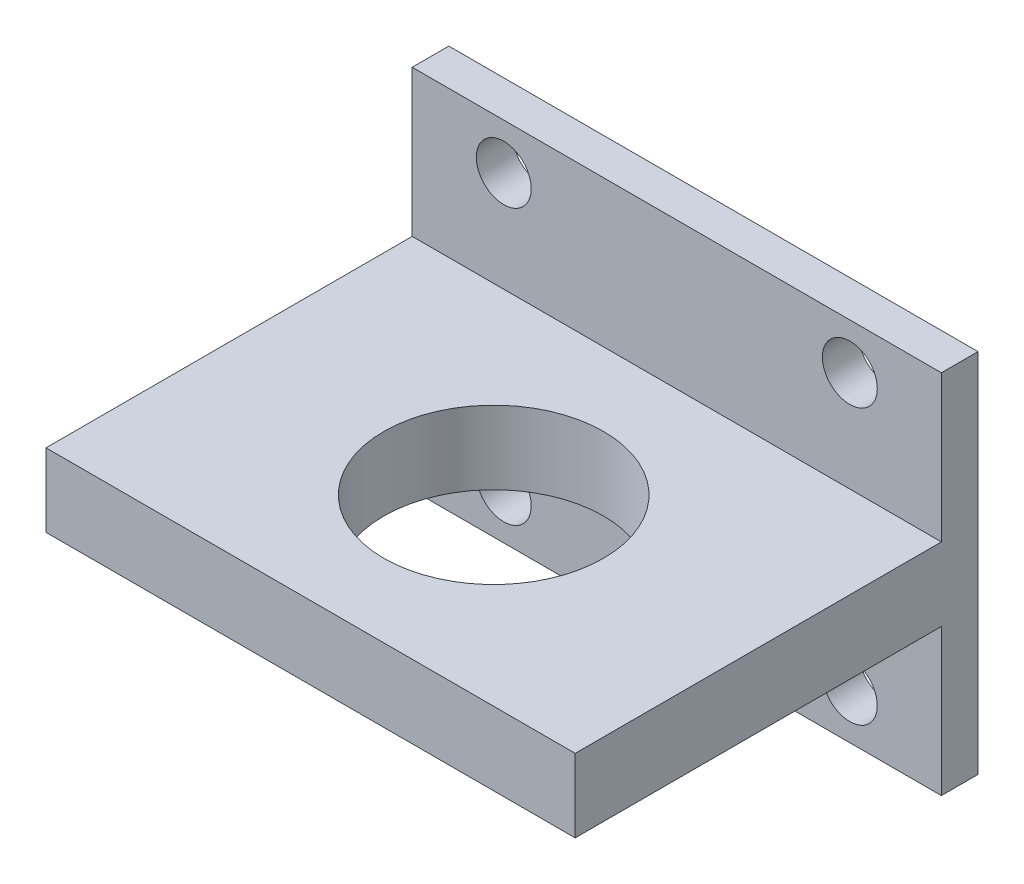
ISO-10303-21;
HEADER;
FILE_DESCRIPTION(('STEP AP214'),'2;1');
FILE_NAME('part.step','',(''),(''),'','','');
FILE_SCHEMA(('AUTOMOTIVE_DESIGN { 1 0 10303 214 1 1 1 1 }'));
ENDSEC;
DATA;
#1=APPLICATION_CONTEXT('core data for automotive mechanical design processes');
#2=APPLICATION_PROTOCOL_DEFINITION('international standard','automotive_design',2000,#1);
#3=PRODUCT_CONTEXT('',#1,'mechanical');
#4=PRODUCT('Part','Part','',(#3));
#5=PRODUCT_RELATED_PRODUCT_CATEGORY('part','',(#4));
#6=PRODUCT_DEFINITION_FORMATION('','',#4);
#7=PRODUCT_DEFINITION_CONTEXT('part definition',#1,'design');
#8=PRODUCT_DEFINITION('design','',#6,#7);
#9=PRODUCT_DEFINITION_SHAPE('','',#8);
#10=(LENGTH_UNIT() NAMED_UNIT(*) SI_UNIT(.MILLI.,.METRE.));
#11=(NAMED_UNIT(*) PLANE_ANGLE_UNIT() SI_UNIT($,.RADIAN.));
#12=(NAMED_UNIT(*) SI_UNIT($,.STERADIAN.) SOLID_ANGLE_UNIT());
#13=UNCERTAINTY_MEASURE_WITH_UNIT(LENGTH_MEASURE(1.E-05),#10,'distance_accuracy_value','');
#14=(GEOMETRIC_REPRESENTATION_CONTEXT(3) GLOBAL_UNCERTAINTY_ASSIGNED_CONTEXT((#13)) GLOBAL_UNIT_ASSIGNED_CONTEXT((#10,
#11,#12)) REPRESENTATION_CONTEXT('',''));
#15=CARTESIAN_POINT('',(0.,0.,0.));
#16=DIRECTION('',(0.,0.,1.));
#17=DIRECTION('',(1.,0.,0.));
#18=AXIS2_PLACEMENT_3D('',#15,#16,#17);
#19=CARTESIAN_POINT('',(0.,0.,2.));
#20=DIRECTION('',(0.,0.,1.));
#21=DIRECTION('',(1.,0.,0.));
#22=AXIS2_PLACEMENT_3D('',#19,#20,#21);
#23=PLANE('',#22);
#24=DIRECTION('',(1.,0.,0.));
#25=VECTOR('',#24,1.);
#26=CARTESIAN_POINT('',(32.5882624485391,33.1580294847158,2.));
#27=LINE('',#26,#25);
#28=CARTESIAN_POINT('',(3.68826244853905,33.1580294847158,2.));
#29=VERTEX_POINT('',#28);
#30=CARTESIAN_POINT('',(32.5882624485391,33.1580294847158,2.));
#31=VERTEX_POINT('',#30);
#32=EDGE_CURVE('E51',#29,#31,#27,.T.);
#33=ORIENTED_EDGE('',*,*,#32,.F.);
#34=DIRECTION('',(0.,-1.,0.));
#35=VECTOR('',#34,1.);
#36=CARTESIAN_POINT('',(3.68826244853905,45.1580294847158,2.));
#37=LINE('',#36,#35);
#38=CARTESIAN_POINT('',(3.68826244853905,25.1580294847158,2.));
#39=VERTEX_POINT('',#38);
#40=EDGE_CURVE('E123',#29,#39,#37,.T.);
#41=ORIENTED_EDGE('',*,*,#40,.T.);
#42=DIRECTION('',(1.,0.,0.));
#43=VECTOR('',#42,1.);
#44=CARTESIAN_POINT('',(3.68826244853905,25.1580294847158,2.));
#45=LINE('',#44,#43);
#46=CARTESIAN_POINT('',(32.5882624485391,25.1580294847158,2.));
#47=VERTEX_POINT('',#46);
#48=EDGE_CURVE('E161',#39,#47,#45,.T.);
#49=ORIENTED_EDGE('',*,*,#48,.T.);
#50=DIRECTION('',(0.,1.,0.));
#51=VECTOR('',#50,1.);
#52=CARTESIAN_POINT('',(32.5882624485391,25.1580294847158,2.));
#53=LINE('',#52,#51);
#54=EDGE_CURVE('E154',#47,#31,#53,.T.);
#55=ORIENTED_EDGE('',*,*,#54,.T.);
#56=EDGE_LOOP('',(#33,#41,#49,#55));
#57=FACE_BOUND('',#56,.T.);
#58=CARTESIAN_POINT('',(27.5882624485391,27.6580294847158,2.));
#59=DIRECTION('',(0.,0.,1.));
#60=DIRECTION('',(-1.,0.,0.));
#61=AXIS2_PLACEMENT_3D('',#58,#59,#60);
#62=CIRCLE('',#61,1.5);
#63=CARTESIAN_POINT('',(26.0882624485391,27.6580294847158,2.));
#64=VERTEX_POINT('',#63);
#65=EDGE_CURVE('E127',#64,#64,#62,.T.);
#66=ORIENTED_EDGE('',*,*,#65,.F.);
#67=EDGE_LOOP('',(#66));
#68=FACE_BOUND('',#67,.T.);
#69=CARTESIAN_POINT('',(8.68826244853906,27.6580294847158,2.));
#70=DIRECTION('',(0.,0.,1.));
#71=DIRECTION('',(1.,0.,0.));
#72=AXIS2_PLACEMENT_3D('',#69,#70,#71);
#73=CIRCLE('',#72,1.5);
#74=CARTESIAN_POINT('',(10.1882624485391,27.6580294847158,2.));
#75=VERTEX_POINT('',#74);
#76=EDGE_CURVE('E136',#75,#75,#73,.T.);
#77=ORIENTED_EDGE('',*,*,#76,.F.);
#78=EDGE_LOOP('',(#77));
#79=FACE_BOUND('',#78,.T.);
#80=ADVANCED_FACE('F35',(#57,#68,#79),#23,.T.);
#81=DIRECTION('',(-1.,0.,0.));
#82=VECTOR('',#81,1.);
#83=CARTESIAN_POINT('',(3.68826244853905,37.1580294847158,2.));
#84=LINE('',#83,#82);
#85=CARTESIAN_POINT('',(32.5882624485391,37.1580294847158,2.));
#86=VERTEX_POINT('',#85);
#87=CARTESIAN_POINT('',(3.68826244853905,37.1580294847158,2.));
#88=VERTEX_POINT('',#87);
#89=EDGE_CURVE('E59',#86,#88,#84,.T.);
#90=ORIENTED_EDGE('',*,*,#89,.F.);
#91=CARTESIAN_POINT('',(32.5882624485391,45.1580294847158,2.));
#92=VERTEX_POINT('',#91);
#93=EDGE_CURVE('E157',#86,#92,#53,.T.);
#94=ORIENTED_EDGE('',*,*,#93,.T.);
#95=DIRECTION('',(-1.,0.,0.));
#96=VECTOR('',#95,1.);
#97=CARTESIAN_POINT('',(32.5882624485391,45.1580294847158,2.));
#98=LINE('',#97,#96);
#99=CARTESIAN_POINT('',(3.68826244853905,45.1580294847158,2.));
#100=VERTEX_POINT('',#99);
#101=EDGE_CURVE('E156',#92,#100,#98,.T.);
#102=ORIENTED_EDGE('',*,*,#101,.T.);
#103=EDGE_CURVE('E159',#100,#88,#37,.T.);
#104=ORIENTED_EDGE('',*,*,#103,.T.);
#105=EDGE_LOOP('',(#90,#94,#102,#104));
#106=FACE_BOUND('',#105,.T.);
#107=CARTESIAN_POINT('',(27.5882624485391,42.6580294847158,2.));
#108=DIRECTION('',(0.,0.,1.));
#109=DIRECTION('',(1.,0.,0.));
#110=AXIS2_PLACEMENT_3D('',#107,#108,#109);
#111=CIRCLE('',#110,1.5);
#112=CARTESIAN_POINT('',(29.0882624485391,42.6580294847158,2.));
#113=VERTEX_POINT('',#112);
#114=EDGE_CURVE('E148',#113,#113,#111,.T.);
#115=ORIENTED_EDGE('',*,*,#114,.F.);
#116=EDGE_LOOP('',(#115));
#117=FACE_BOUND('',#116,.T.);
#118=CARTESIAN_POINT('',(8.68826244853906,42.6580294847158,2.));
#119=DIRECTION('',(0.,0.,1.));
#120=DIRECTION('',(-1.,0.,0.));
#121=AXIS2_PLACEMENT_3D('',#118,#119,#120);
#122=CIRCLE('',#121,1.5);
#123=CARTESIAN_POINT('',(7.18826244853906,42.6580294847158,2.));
#124=VERTEX_POINT('',#123);
#125=EDGE_CURVE('E142',#124,#124,#122,.T.);
#126=ORIENTED_EDGE('',*,*,#125,.F.);
#127=EDGE_LOOP('',(#126));
#128=FACE_BOUND('',#127,.T.);
#129=ADVANCED_FACE('F208',(#106,#117,#128),#23,.T.);
#130=CARTESIAN_POINT('',(0.,0.,0.));
#131=DIRECTION('',(0.,0.,1.));
#132=DIRECTION('',(1.,0.,0.));
#133=AXIS2_PLACEMENT_3D('',#130,#131,#132);
#134=PLANE('',#133);
#135=DIRECTION('',(0.,1.,0.));
#136=VECTOR('',#135,1.);
#137=CARTESIAN_POINT('',(32.5882624485391,25.1580294847158,0.));
#138=LINE('',#137,#136);
#139=CARTESIAN_POINT('',(32.5882624485391,25.1580294847158,0.));
#140=VERTEX_POINT('',#139);
#141=CARTESIAN_POINT('',(32.5882624485391,45.1580294847158,0.));
#142=VERTEX_POINT('',#141);
#143=EDGE_CURVE('E151',#140,#142,#138,.T.);
#144=ORIENTED_EDGE('',*,*,#143,.F.);
#145=DIRECTION('',(1.,0.,0.));
#146=VECTOR('',#145,1.);
#147=CARTESIAN_POINT('',(3.68826244853905,25.1580294847158,0.));
#148=LINE('',#147,#146);
#149=CARTESIAN_POINT('',(3.68826244853905,25.1580294847158,0.));
#150=VERTEX_POINT('',#149);
#151=EDGE_CURVE('E170',#150,#140,#148,.T.);
#152=ORIENTED_EDGE('',*,*,#151,.F.);
#153=DIRECTION('',(0.,-1.,0.));
#154=VECTOR('',#153,1.);
#155=CARTESIAN_POINT('',(3.68826244853905,45.1580294847158,0.));
#156=LINE('',#155,#154);
#157=CARTESIAN_POINT('',(3.68826244853905,45.1580294847158,0.));
#158=VERTEX_POINT('',#157);
#159=EDGE_CURVE('E168',#158,#150,#156,.T.);
#160=ORIENTED_EDGE('',*,*,#159,.F.);
#161=DIRECTION('',(-1.,0.,0.));
#162=VECTOR('',#161,1.);
#163=CARTESIAN_POINT('',(32.5882624485391,45.1580294847158,0.));
#164=LINE('',#163,#162);
#165=EDGE_CURVE('E166',#142,#158,#164,.T.);
#166=ORIENTED_EDGE('',*,*,#165,.F.);
#167=EDGE_LOOP('',(#144,#152,#160,#166));
#168=FACE_BOUND('',#167,.T.);
#169=CARTESIAN_POINT('',(27.5882624485391,42.6580294847158,0.));
#170=DIRECTION('',(0.,0.,1.));
#171=DIRECTION('',(1.,0.,0.));
#172=AXIS2_PLACEMENT_3D('',#169,#170,#171);
#173=CIRCLE('',#172,1.5);
#174=CARTESIAN_POINT('',(29.0882624485391,42.6580294847158,0.));
#175=VERTEX_POINT('',#174);
#176=EDGE_CURVE('E145',#175,#175,#173,.T.);
#177=ORIENTED_EDGE('',*,*,#176,.T.);
#178=EDGE_LOOP('',(#177));
#179=FACE_BOUND('',#178,.T.);
#180=CARTESIAN_POINT('',(8.68826244853906,42.6580294847158,0.));
#181=DIRECTION('',(0.,0.,1.));
#182=DIRECTION('',(-1.,0.,0.));
#183=AXIS2_PLACEMENT_3D('',#180,#181,#182);
#184=CIRCLE('',#183,1.5);
#185=CARTESIAN_POINT('',(7.18826244853906,42.6580294847158,0.));
#186=VERTEX_POINT('',#185);
#187=EDGE_CURVE('E139',#186,#186,#184,.T.);
#188=ORIENTED_EDGE('',*,*,#187,.T.);
#189=EDGE_LOOP('',(#188));
#190=FACE_BOUND('',#189,.T.);
#191=CARTESIAN_POINT('',(8.68826244853906,27.6580294847158,0.));
#192=DIRECTION('',(0.,0.,1.));
#193=DIRECTION('',(1.,0.,0.));
#194=AXIS2_PLACEMENT_3D('',#191,#192,#193);
#195=CIRCLE('',#194,1.5);
#196=CARTESIAN_POINT('',(10.1882624485391,27.6580294847158,0.));
#197=VERTEX_POINT('',#196);
#198=EDGE_CURVE('E134',#197,#197,#195,.T.);
#199=ORIENTED_EDGE('',*,*,#198,.T.);
#200=EDGE_LOOP('',(#199));
#201=FACE_BOUND('',#200,.T.);
#202=CARTESIAN_POINT('',(27.5882624485391,27.6580294847158,0.));
#203=DIRECTION('',(0.,0.,1.));
#204=DIRECTION('',(-1.,0.,0.));
#205=AXIS2_PLACEMENT_3D('',#202,#203,#204);
#206=CIRCLE('',#205,1.5);
#207=CARTESIAN_POINT('',(26.0882624485391,27.6580294847158,0.));
#208=VERTEX_POINT('',#207);
#209=EDGE_CURVE('E124',#208,#208,#206,.T.);
#210=ORIENTED_EDGE('',*,*,#209,.T.);
#211=EDGE_LOOP('',(#210));
#212=FACE_BOUND('',#211,.T.);
#213=ADVANCED_FACE('F186',(#168,#179,#190,#201,#212),#134,.F.);
#214=CARTESIAN_POINT('',(32.5882624485391,25.1580294847158,2.));
#215=DIRECTION('',(-1.,0.,0.));
#216=DIRECTION('',(0.,0.,1.));
#217=AXIS2_PLACEMENT_3D('',#214,#215,#216);
#218=PLANE('',#217);
#219=ORIENTED_EDGE('',*,*,#143,.T.);
#220=DIRECTION('',(0.,0.,-1.));
#221=VECTOR('',#220,1.);
#222=CARTESIAN_POINT('',(32.5882624485391,45.1580294847158,2.));
#223=LINE('',#222,#221);
#224=EDGE_CURVE('E11',#92,#142,#223,.T.);
#225=ORIENTED_EDGE('',*,*,#224,.F.);
#226=ORIENTED_EDGE('',*,*,#93,.F.);
#227=DIRECTION('',(0.,0.,-1.));
#228=VECTOR('',#227,1.);
#229=CARTESIAN_POINT('',(32.5882624485391,37.1580294847158,22.));
#230=LINE('',#229,#228);
#231=CARTESIAN_POINT('',(32.5882624485391,37.1580294847158,22.));
#232=VERTEX_POINT('',#231);
#233=EDGE_CURVE('E129',#232,#86,#230,.T.);
#234=ORIENTED_EDGE('',*,*,#233,.F.);
#235=DIRECTION('',(0.,1.,0.));
#236=VECTOR('',#235,1.);
#237=CARTESIAN_POINT('',(32.5882624485391,37.1580294847158,22.));
#238=LINE('',#237,#236);
#239=CARTESIAN_POINT('',(32.5882624485391,33.1580294847158,22.));
#240=VERTEX_POINT('',#239);
#241=EDGE_CURVE('E110',#240,#232,#238,.T.);
#242=ORIENTED_EDGE('',*,*,#241,.F.);
#243=DIRECTION('',(0.,0.,-1.));
#244=VECTOR('',#243,1.);
#245=CARTESIAN_POINT('',(32.5882624485391,33.1580294847158,22.));
#246=LINE('',#245,#244);
#247=EDGE_CURVE('E107',#240,#31,#246,.T.);
#248=ORIENTED_EDGE('',*,*,#247,.T.);
#249=ORIENTED_EDGE('',*,*,#54,.F.);
#250=DIRECTION('',(0.,0.,-1.));
#251=VECTOR('',#250,1.);
#252=CARTESIAN_POINT('',(32.5882624485391,25.1580294847158,2.));
#253=LINE('',#252,#251);
#254=EDGE_CURVE('E163',#47,#140,#253,.T.);
#255=ORIENTED_EDGE('',*,*,#254,.T.);
#256=EDGE_LOOP('',(#219,#225,#226,#234,#242,#248,#249,#255));
#257=FACE_BOUND('',#256,.T.);
#258=ADVANCED_FACE('F37',(#257),#218,.F.);
#259=CARTESIAN_POINT('',(32.5882624485391,45.1580294847158,2.));
#260=DIRECTION('',(0.,-1.,0.));
#261=DIRECTION('',(0.,0.,-1.));
#262=AXIS2_PLACEMENT_3D('',#259,#260,#261);
#263=PLANE('',#262);
#264=ORIENTED_EDGE('',*,*,#165,.T.);
#265=DIRECTION('',(0.,0.,-1.));
#266=VECTOR('',#265,1.);
#267=CARTESIAN_POINT('',(3.68826244853905,45.1580294847158,2.));
#268=LINE('',#267,#266);
#269=EDGE_CURVE('E44',#100,#158,#268,.T.);
#270=ORIENTED_EDGE('',*,*,#269,.F.);
#271=ORIENTED_EDGE('',*,*,#101,.F.);
#272=ORIENTED_EDGE('',*,*,#224,.T.);
#273=EDGE_LOOP('',(#264,#270,#271,#272));
#274=FACE_BOUND('',#273,.T.);
#275=ADVANCED_FACE('F210',(#274),#263,.F.);
#276=CARTESIAN_POINT('',(3.68826244853905,45.1580294847158,2.));
#277=DIRECTION('',(1.,0.,0.));
#278=DIRECTION('',(0.,0.,-1.));
#279=AXIS2_PLACEMENT_3D('',#276,#277,#278);
#280=PLANE('',#279);
#281=ORIENTED_EDGE('',*,*,#159,.T.);
#282=DIRECTION('',(0.,0.,-1.));
#283=VECTOR('',#282,1.);
#284=CARTESIAN_POINT('',(3.68826244853905,25.1580294847158,2.));
#285=LINE('',#284,#283);
#286=EDGE_CURVE('E174',#39,#150,#285,.T.);
#287=ORIENTED_EDGE('',*,*,#286,.F.);
#288=ORIENTED_EDGE('',*,*,#40,.F.);
#289=DIRECTION('',(0.,0.,-1.));
#290=VECTOR('',#289,1.);
#291=CARTESIAN_POINT('',(3.68826244853905,33.1580294847158,22.));
#292=LINE('',#291,#290);
#293=CARTESIAN_POINT('',(3.68826244853905,33.1580294847158,22.));
#294=VERTEX_POINT('',#293);
#295=EDGE_CURVE('E105',#294,#29,#292,.T.);
#296=ORIENTED_EDGE('',*,*,#295,.F.);
#297=DIRECTION('',(0.,-1.,0.));
#298=VECTOR('',#297,1.);
#299=CARTESIAN_POINT('',(3.68826244853905,33.1580294847158,22.));
#300=LINE('',#299,#298);
#301=CARTESIAN_POINT('',(3.68826244853905,37.1580294847158,22.));
#302=VERTEX_POINT('',#301);
#303=EDGE_CURVE('E111',#302,#294,#300,.T.);
#304=ORIENTED_EDGE('',*,*,#303,.F.);
#305=DIRECTION('',(0.,0.,-1.));
#306=VECTOR('',#305,1.);
#307=CARTESIAN_POINT('',(3.68826244853905,37.1580294847158,22.));
#308=LINE('',#307,#306);
#309=EDGE_CURVE('E203',#302,#88,#308,.T.);
#310=ORIENTED_EDGE('',*,*,#309,.T.);
#311=ORIENTED_EDGE('',*,*,#103,.F.);
#312=ORIENTED_EDGE('',*,*,#269,.T.);
#313=EDGE_LOOP('',(#281,#287,#288,#296,#304,#310,#311,#312));
#314=FACE_BOUND('',#313,.T.);
#315=ADVANCED_FACE('F121',(#314),#280,.F.);
#316=CARTESIAN_POINT('',(3.68826244853905,25.1580294847158,2.));
#317=DIRECTION('',(0.,1.,0.));
#318=DIRECTION('',(0.,0.,1.));
#319=AXIS2_PLACEMENT_3D('',#316,#317,#318);
#320=PLANE('',#319);
#321=ORIENTED_EDGE('',*,*,#151,.T.);
#322=ORIENTED_EDGE('',*,*,#254,.F.);
#323=ORIENTED_EDGE('',*,*,#48,.F.);
#324=ORIENTED_EDGE('',*,*,#286,.T.);
#325=EDGE_LOOP('',(#321,#322,#323,#324));
#326=FACE_BOUND('',#325,.T.);
#327=ADVANCED_FACE('F190',(#326),#320,.F.);
#328=CARTESIAN_POINT('',(27.5882624485391,42.6580294847158,2.));
#329=DIRECTION('',(0.,0.,-1.));
#330=DIRECTION('',(-1.,0.,0.));
#331=AXIS2_PLACEMENT_3D('',#328,#329,#330);
#332=CYLINDRICAL_SURFACE('',#331,1.5);
#333=ORIENTED_EDGE('',*,*,#114,.T.);
#334=EDGE_LOOP('',(#333));
#335=FACE_BOUND('',#334,.T.);
#336=ORIENTED_EDGE('',*,*,#176,.F.);
#337=EDGE_LOOP('',(#336));
#338=FACE_BOUND('',#337,.T.);
#339=ADVANCED_FACE('F224',(#335,#338),#332,.F.);
#340=CARTESIAN_POINT('',(8.68826244853906,42.6580294847158,2.));
#341=DIRECTION('',(0.,0.,-1.));
#342=DIRECTION('',(-1.,0.,0.));
#343=AXIS2_PLACEMENT_3D('',#340,#341,#342);
#344=CYLINDRICAL_SURFACE('',#343,1.5);
#345=ORIENTED_EDGE('',*,*,#125,.T.);
#346=EDGE_LOOP('',(#345));
#347=FACE_BOUND('',#346,.T.);
#348=ORIENTED_EDGE('',*,*,#187,.F.);
#349=EDGE_LOOP('',(#348));
#350=FACE_BOUND('',#349,.T.);
#351=ADVANCED_FACE('F232',(#347,#350),#344,.F.);
#352=CARTESIAN_POINT('',(8.68826244853906,27.6580294847158,2.));
#353=DIRECTION('',(0.,0.,-1.));
#354=DIRECTION('',(-1.,0.,0.));
#355=AXIS2_PLACEMENT_3D('',#352,#353,#354);
#356=CYLINDRICAL_SURFACE('',#355,1.5);
#357=ORIENTED_EDGE('',*,*,#76,.T.);
#358=EDGE_LOOP('',(#357));
#359=FACE_BOUND('',#358,.T.);
#360=ORIENTED_EDGE('',*,*,#198,.F.);
#361=EDGE_LOOP('',(#360));
#362=FACE_BOUND('',#361,.T.);
#363=ADVANCED_FACE('F237',(#359,#362),#356,.F.);
#364=CARTESIAN_POINT('',(27.5882624485391,27.6580294847158,2.));
#365=DIRECTION('',(0.,0.,-1.));
#366=DIRECTION('',(-1.,0.,0.));
#367=AXIS2_PLACEMENT_3D('',#364,#365,#366);
#368=CYLINDRICAL_SURFACE('',#367,1.5);
#369=ORIENTED_EDGE('',*,*,#65,.T.);
#370=EDGE_LOOP('',(#369));
#371=FACE_BOUND('',#370,.T.);
#372=ORIENTED_EDGE('',*,*,#209,.F.);
#373=EDGE_LOOP('',(#372));
#374=FACE_BOUND('',#373,.T.);
#375=ADVANCED_FACE('F249',(#371,#374),#368,.F.);
#376=CARTESIAN_POINT('',(32.5882624485391,33.1580294847158,22.));
#377=DIRECTION('',(0.,1.,0.));
#378=DIRECTION('',(0.,0.,1.));
#379=AXIS2_PLACEMENT_3D('',#376,#377,#378);
#380=PLANE('',#379);
#381=CARTESIAN_POINT('',(18.1382624485391,33.1580294847158,12.));
#382=DIRECTION('',(0.,-1.,0.));
#383=DIRECTION('',(0.,0.,-1.));
#384=AXIS2_PLACEMENT_3D('',#381,#382,#383);
#385=CIRCLE('',#384,6.);
#386=CARTESIAN_POINT('',(18.1382624485391,33.1580294847158,6.));
#387=VERTEX_POINT('',#386);
#388=EDGE_CURVE('E199',#387,#387,#385,.T.);
#389=ORIENTED_EDGE('',*,*,#388,.F.);
#390=EDGE_LOOP('',(#389));
#391=FACE_BOUND('',#390,.T.);
#392=ORIENTED_EDGE('',*,*,#32,.T.);
#393=ORIENTED_EDGE('',*,*,#247,.F.);
#394=DIRECTION('',(1.,0.,0.));
#395=VECTOR('',#394,1.);
#396=CARTESIAN_POINT('',(32.5882624485391,33.1580294847158,22.));
#397=LINE('',#396,#395);
#398=EDGE_CURVE('E101',#294,#240,#397,.T.);
#399=ORIENTED_EDGE('',*,*,#398,.F.);
#400=ORIENTED_EDGE('',*,*,#295,.T.);
#401=EDGE_LOOP('',(#392,#393,#399,#400));
#402=FACE_BOUND('',#401,.T.);
#403=ADVANCED_FACE('F103',(#391,#402),#380,.F.);
#404=CARTESIAN_POINT('',(3.68826244853905,37.1580294847158,22.));
#405=DIRECTION('',(0.,-1.,0.));
#406=DIRECTION('',(0.,0.,-1.));
#407=AXIS2_PLACEMENT_3D('',#404,#405,#406);
#408=PLANE('',#407);
#409=CARTESIAN_POINT('',(18.1382624485391,37.1580294847158,12.));
#410=DIRECTION('',(0.,-1.,0.));
#411=DIRECTION('',(0.,0.,-1.));
#412=AXIS2_PLACEMENT_3D('',#409,#410,#411);
#413=CIRCLE('',#412,6.);
#414=CARTESIAN_POINT('',(18.1382624485391,37.1580294847158,6.));
#415=VERTEX_POINT('',#414);
#416=EDGE_CURVE('E39',#415,#415,#413,.T.);
#417=ORIENTED_EDGE('',*,*,#416,.T.);
#418=EDGE_LOOP('',(#417));
#419=FACE_BOUND('',#418,.T.);
#420=ORIENTED_EDGE('',*,*,#89,.T.);
#421=ORIENTED_EDGE('',*,*,#309,.F.);
#422=DIRECTION('',(-1.,0.,0.));
#423=VECTOR('',#422,1.);
#424=CARTESIAN_POINT('',(3.68826244853905,37.1580294847158,22.));
#425=LINE('',#424,#423);
#426=EDGE_CURVE('E116',#232,#302,#425,.T.);
#427=ORIENTED_EDGE('',*,*,#426,.F.);
#428=ORIENTED_EDGE('',*,*,#233,.T.);
#429=EDGE_LOOP('',(#420,#421,#427,#428));
#430=FACE_BOUND('',#429,.T.);
#431=ADVANCED_FACE('F207',(#419,#430),#408,.F.);
#432=CARTESIAN_POINT('',(0.,0.,22.));
#433=DIRECTION('',(0.,0.,-1.));
#434=DIRECTION('',(-1.,0.,0.));
#435=AXIS2_PLACEMENT_3D('',#432,#433,#434);
#436=PLANE('',#435);
#437=ORIENTED_EDGE('',*,*,#303,.T.);
#438=ORIENTED_EDGE('',*,*,#398,.T.);
#439=ORIENTED_EDGE('',*,*,#241,.T.);
#440=ORIENTED_EDGE('',*,*,#426,.T.);
#441=EDGE_LOOP('',(#437,#438,#439,#440));
#442=FACE_BOUND('',#441,.T.);
#443=ADVANCED_FACE('F114',(#442),#436,.F.);
#444=CARTESIAN_POINT('',(18.1382624485391,43.1580294847158,12.));
#445=DIRECTION('',(0.,-1.,0.));
#446=DIRECTION('',(0.,0.,-1.));
#447=AXIS2_PLACEMENT_3D('',#444,#445,#446);
#448=CYLINDRICAL_SURFACE('',#447,6.);
#449=ORIENTED_EDGE('',*,*,#388,.T.);
#450=EDGE_LOOP('',(#449));
#451=FACE_BOUND('',#450,.T.);
#452=ORIENTED_EDGE('',*,*,#416,.F.);
#453=EDGE_LOOP('',(#452));
#454=FACE_BOUND('',#453,.T.);
#455=ADVANCED_FACE('F267',(#451,#454),#448,.F.);
#456=CLOSED_SHELL('',(#80,#129,#213,#258,#275,#315,#327,#339,#351,#363,#375,#403,#431,#443,#455));
#457=MANIFOLD_SOLID_BREP('B2',#456);
#458=ADVANCED_BREP_SHAPE_REPRESENTATION('',(#18,#457),#14);
#459=SHAPE_DEFINITION_REPRESENTATION(#9,#458);
ENDSEC;
END-ISO-10303-21;
